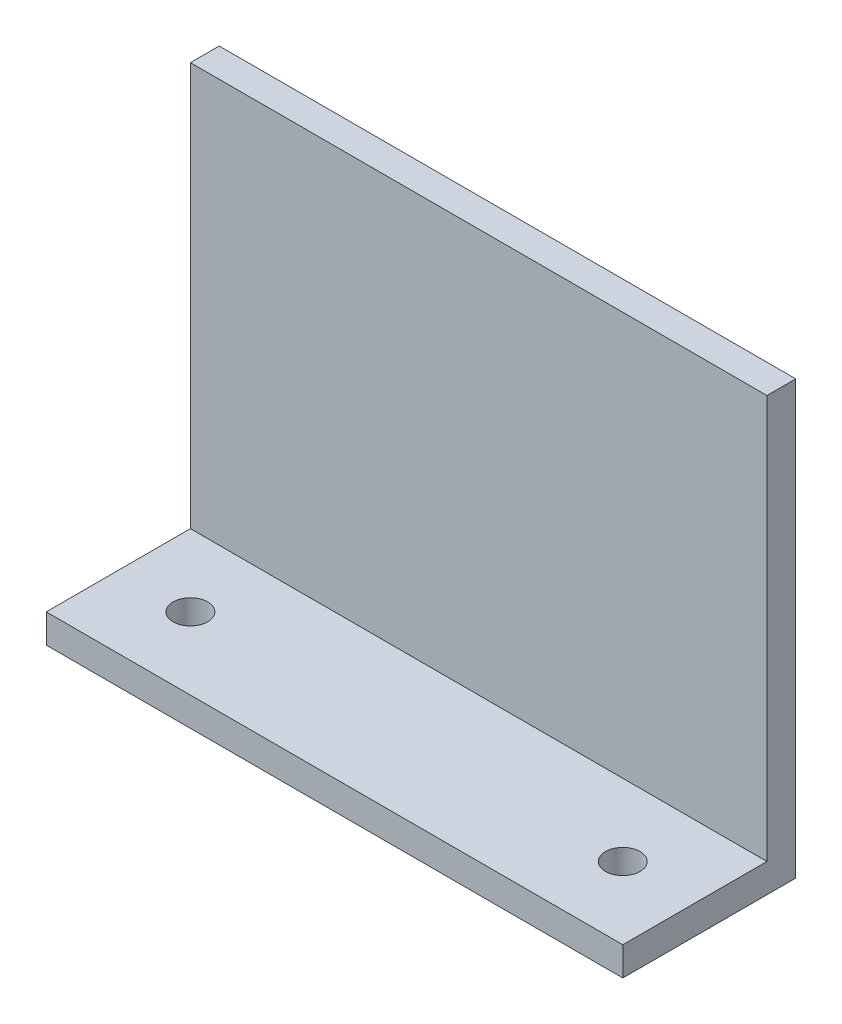
ISO-10303-21;
HEADER;
FILE_DESCRIPTION(('STEP AP214'),'2;1');
FILE_NAME('part.step','',(''),(''),'','','');
FILE_SCHEMA(('AUTOMOTIVE_DESIGN { 1 0 10303 214 1 1 1 1 }'));
ENDSEC;
DATA;
#1=APPLICATION_CONTEXT('core data for automotive mechanical design processes');
#2=APPLICATION_PROTOCOL_DEFINITION('international standard','automotive_design',2000,#1);
#3=PRODUCT_CONTEXT('',#1,'mechanical');
#4=PRODUCT('Part','Part','',(#3));
#5=PRODUCT_RELATED_PRODUCT_CATEGORY('part','',(#4));
#6=PRODUCT_DEFINITION_FORMATION('','',#4);
#7=PRODUCT_DEFINITION_CONTEXT('part definition',#1,'design');
#8=PRODUCT_DEFINITION('design','',#6,#7);
#9=PRODUCT_DEFINITION_SHAPE('','',#8);
#10=(LENGTH_UNIT() NAMED_UNIT(*) SI_UNIT(.MILLI.,.METRE.));
#11=(NAMED_UNIT(*) PLANE_ANGLE_UNIT() SI_UNIT($,.RADIAN.));
#12=(NAMED_UNIT(*) SI_UNIT($,.STERADIAN.) SOLID_ANGLE_UNIT());
#13=UNCERTAINTY_MEASURE_WITH_UNIT(LENGTH_MEASURE(1.E-05),#10,'distance_accuracy_value','');
#14=(GEOMETRIC_REPRESENTATION_CONTEXT(3) GLOBAL_UNCERTAINTY_ASSIGNED_CONTEXT((#13)) GLOBAL_UNIT_ASSIGNED_CONTEXT((#10,
#11,#12)) REPRESENTATION_CONTEXT('',''));
#15=CARTESIAN_POINT('',(0.,0.,0.));
#16=DIRECTION('',(0.,0.,1.));
#17=DIRECTION('',(1.,0.,0.));
#18=AXIS2_PLACEMENT_3D('',#15,#16,#17);
#19=CARTESIAN_POINT('',(0.,0.,10.));
#20=DIRECTION('',(0.,0.,-1.));
#21=DIRECTION('',(-1.,0.,0.));
#22=AXIS2_PLACEMENT_3D('',#19,#20,#21);
#23=PLANE('',#22);
#24=DIRECTION('',(-1.,0.,0.));
#25=VECTOR('',#24,1.);
#26=CARTESIAN_POINT('',(-100.,-65.,10.));
#27=LINE('',#26,#25);
#28=CARTESIAN_POINT('',(100.,-65.,10.));
#29=VERTEX_POINT('',#28);
#30=CARTESIAN_POINT('',(-100.,-65.,10.));
#31=VERTEX_POINT('',#30);
#32=EDGE_CURVE('E48',#29,#31,#27,.T.);
#33=ORIENTED_EDGE('',*,*,#32,.F.);
#34=DIRECTION('',(0.,1.,0.));
#35=VECTOR('',#34,1.);
#36=CARTESIAN_POINT('',(100.,-75.,10.));
#37=LINE('',#36,#35);
#38=CARTESIAN_POINT('',(100.,75.,10.));
#39=VERTEX_POINT('',#38);
#40=EDGE_CURVE('E86',#29,#39,#37,.T.);
#41=ORIENTED_EDGE('',*,*,#40,.T.);
#42=DIRECTION('',(-1.,0.,0.));
#43=VECTOR('',#42,1.);
#44=CARTESIAN_POINT('',(-100.,75.,10.));
#45=LINE('',#44,#43);
#46=CARTESIAN_POINT('',(-100.,75.,10.));
#47=VERTEX_POINT('',#46);
#48=EDGE_CURVE('E54',#39,#47,#45,.T.);
#49=ORIENTED_EDGE('',*,*,#48,.T.);
#50=DIRECTION('',(0.,-1.,0.));
#51=VECTOR('',#50,1.);
#52=CARTESIAN_POINT('',(-100.,-75.,10.));
#53=LINE('',#52,#51);
#54=EDGE_CURVE('E97',#47,#31,#53,.T.);
#55=ORIENTED_EDGE('',*,*,#54,.T.);
#56=EDGE_LOOP('',(#33,#41,#49,#55));
#57=FACE_BOUND('',#56,.T.);
#58=ADVANCED_FACE('F33',(#57),#23,.F.);
#59=CARTESIAN_POINT('',(100.,-75.,10.));
#60=DIRECTION('',(-1.,0.,0.));
#61=DIRECTION('',(0.,0.,1.));
#62=AXIS2_PLACEMENT_3D('',#59,#60,#61);
#63=PLANE('',#62);
#64=DIRECTION('',(0.,1.,0.));
#65=VECTOR('',#64,1.);
#66=CARTESIAN_POINT('',(100.,-75.,0.));
#67=LINE('',#66,#65);
#68=CARTESIAN_POINT('',(100.,-75.,0.));
#69=VERTEX_POINT('',#68);
#70=CARTESIAN_POINT('',(100.,75.,0.));
#71=VERTEX_POINT('',#70);
#72=EDGE_CURVE('E93',#69,#71,#67,.T.);
#73=ORIENTED_EDGE('',*,*,#72,.T.);
#74=DIRECTION('',(0.,0.,-1.));
#75=VECTOR('',#74,1.);
#76=CARTESIAN_POINT('',(100.,75.,10.));
#77=LINE('',#76,#75);
#78=EDGE_CURVE('E11',#39,#71,#77,.T.);
#79=ORIENTED_EDGE('',*,*,#78,.F.);
#80=ORIENTED_EDGE('',*,*,#40,.F.);
#81=DIRECTION('',(0.,0.,-1.));
#82=VECTOR('',#81,1.);
#83=CARTESIAN_POINT('',(100.,-65.,60.));
#84=LINE('',#83,#82);
#85=CARTESIAN_POINT('',(100.,-65.,60.));
#86=VERTEX_POINT('',#85);
#87=EDGE_CURVE('E101',#86,#29,#84,.T.);
#88=ORIENTED_EDGE('',*,*,#87,.F.);
#89=DIRECTION('',(0.,1.,0.));
#90=VECTOR('',#89,1.);
#91=CARTESIAN_POINT('',(100.,-75.,60.));
#92=LINE('',#91,#90);
#93=CARTESIAN_POINT('',(100.,-75.,60.));
#94=VERTEX_POINT('',#93);
#95=EDGE_CURVE('E96',#94,#86,#92,.T.);
#96=ORIENTED_EDGE('',*,*,#95,.F.);
#97=DIRECTION('',(0.,0.,-1.));
#98=VECTOR('',#97,1.);
#99=CARTESIAN_POINT('',(100.,-75.,10.));
#100=LINE('',#99,#98);
#101=EDGE_CURVE('E79',#94,#69,#100,.T.);
#102=ORIENTED_EDGE('',*,*,#101,.T.);
#103=EDGE_LOOP('',(#73,#79,#80,#88,#96,#102));
#104=FACE_BOUND('',#103,.T.);
#105=ADVANCED_FACE('F35',(#104),#63,.F.);
#106=CARTESIAN_POINT('',(-100.,75.,10.));
#107=DIRECTION('',(0.,-1.,0.));
#108=DIRECTION('',(0.,0.,-1.));
#109=AXIS2_PLACEMENT_3D('',#106,#107,#108);
#110=PLANE('',#109);
#111=DIRECTION('',(-1.,0.,0.));
#112=VECTOR('',#111,1.);
#113=CARTESIAN_POINT('',(-100.,75.,0.));
#114=LINE('',#113,#112);
#115=CARTESIAN_POINT('',(-100.,75.,0.));
#116=VERTEX_POINT('',#115);
#117=EDGE_CURVE('E100',#71,#116,#114,.T.);
#118=ORIENTED_EDGE('',*,*,#117,.T.);
#119=DIRECTION('',(0.,0.,-1.));
#120=VECTOR('',#119,1.);
#121=CARTESIAN_POINT('',(-100.,75.,10.));
#122=LINE('',#121,#120);
#123=EDGE_CURVE('E41',#47,#116,#122,.T.);
#124=ORIENTED_EDGE('',*,*,#123,.F.);
#125=ORIENTED_EDGE('',*,*,#48,.F.);
#126=ORIENTED_EDGE('',*,*,#78,.T.);
#127=EDGE_LOOP('',(#118,#124,#125,#126));
#128=FACE_BOUND('',#127,.T.);
#129=ADVANCED_FACE('F117',(#128),#110,.F.);
#130=CARTESIAN_POINT('',(-100.,-75.,10.));
#131=DIRECTION('',(1.,0.,0.));
#132=DIRECTION('',(0.,0.,-1.));
#133=AXIS2_PLACEMENT_3D('',#130,#131,#132);
#134=PLANE('',#133);
#135=DIRECTION('',(0.,-1.,0.));
#136=VECTOR('',#135,1.);
#137=CARTESIAN_POINT('',(-100.,-75.,0.));
#138=LINE('',#137,#136);
#139=CARTESIAN_POINT('',(-100.,-75.,0.));
#140=VERTEX_POINT('',#139);
#141=EDGE_CURVE('E87',#116,#140,#138,.T.);
#142=ORIENTED_EDGE('',*,*,#141,.T.);
#143=DIRECTION('',(0.,0.,-1.));
#144=VECTOR('',#143,1.);
#145=CARTESIAN_POINT('',(-100.,-75.,10.));
#146=LINE('',#145,#144);
#147=CARTESIAN_POINT('',(-100.,-75.,60.));
#148=VERTEX_POINT('',#147);
#149=EDGE_CURVE('E82',#148,#140,#146,.T.);
#150=ORIENTED_EDGE('',*,*,#149,.F.);
#151=DIRECTION('',(0.,-1.,0.));
#152=VECTOR('',#151,1.);
#153=CARTESIAN_POINT('',(-100.,-75.,60.));
#154=LINE('',#153,#152);
#155=CARTESIAN_POINT('',(-100.,-65.,60.));
#156=VERTEX_POINT('',#155);
#157=EDGE_CURVE('E137',#156,#148,#154,.T.);
#158=ORIENTED_EDGE('',*,*,#157,.F.);
#159=DIRECTION('',(0.,0.,-1.));
#160=VECTOR('',#159,1.);
#161=CARTESIAN_POINT('',(-100.,-65.,60.));
#162=LINE('',#161,#160);
#163=EDGE_CURVE('E105',#156,#31,#162,.T.);
#164=ORIENTED_EDGE('',*,*,#163,.T.);
#165=ORIENTED_EDGE('',*,*,#54,.F.);
#166=ORIENTED_EDGE('',*,*,#123,.T.);
#167=EDGE_LOOP('',(#142,#150,#158,#164,#165,#166));
#168=FACE_BOUND('',#167,.T.);
#169=ADVANCED_FACE('F114',(#168),#134,.F.);
#170=CARTESIAN_POINT('',(-100.,-75.,10.));
#171=DIRECTION('',(0.,1.,0.));
#172=DIRECTION('',(0.,0.,1.));
#173=AXIS2_PLACEMENT_3D('',#170,#171,#172);
#174=PLANE('',#173);
#175=CARTESIAN_POINT('',(75.,-75.,35.));
#176=DIRECTION('',(0.,1.,0.));
#177=DIRECTION('',(0.,0.,1.));
#178=AXIS2_PLACEMENT_3D('',#175,#176,#177);
#179=CIRCLE('',#178,6.00000000000001);
#180=CARTESIAN_POINT('',(75.,-75.,41.));
#181=VERTEX_POINT('',#180);
#182=EDGE_CURVE('E154',#181,#181,#179,.T.);
#183=ORIENTED_EDGE('',*,*,#182,.T.);
#184=EDGE_LOOP('',(#183));
#185=FACE_BOUND('',#184,.T.);
#186=CARTESIAN_POINT('',(-75.,-75.,35.));
#187=DIRECTION('',(0.,1.,0.));
#188=DIRECTION('',(0.,0.,1.));
#189=AXIS2_PLACEMENT_3D('',#186,#187,#188);
#190=CIRCLE('',#189,6.00000000000001);
#191=CARTESIAN_POINT('',(-75.,-75.,41.));
#192=VERTEX_POINT('',#191);
#193=EDGE_CURVE('E138',#192,#192,#190,.T.);
#194=ORIENTED_EDGE('',*,*,#193,.T.);
#195=EDGE_LOOP('',(#194));
#196=FACE_BOUND('',#195,.T.);
#197=DIRECTION('',(1.,0.,0.));
#198=VECTOR('',#197,1.);
#199=CARTESIAN_POINT('',(-100.,-75.,0.));
#200=LINE('',#199,#198);
#201=EDGE_CURVE('E74',#140,#69,#200,.T.);
#202=ORIENTED_EDGE('',*,*,#201,.T.);
#203=ORIENTED_EDGE('',*,*,#101,.F.);
#204=DIRECTION('',(1.,0.,0.));
#205=VECTOR('',#204,1.);
#206=CARTESIAN_POINT('',(-100.,-75.,60.));
#207=LINE('',#206,#205);
#208=EDGE_CURVE('E133',#148,#94,#207,.T.);
#209=ORIENTED_EDGE('',*,*,#208,.F.);
#210=ORIENTED_EDGE('',*,*,#149,.T.);
#211=EDGE_LOOP('',(#202,#203,#209,#210));
#212=FACE_BOUND('',#211,.T.);
#213=ADVANCED_FACE('F76',(#185,#196,#212),#174,.F.);
#214=CARTESIAN_POINT('',(0.,0.,0.));
#215=DIRECTION('',(0.,0.,-1.));
#216=DIRECTION('',(-1.,0.,0.));
#217=AXIS2_PLACEMENT_3D('',#214,#215,#216);
#218=PLANE('',#217);
#219=ORIENTED_EDGE('',*,*,#72,.F.);
#220=ORIENTED_EDGE('',*,*,#201,.F.);
#221=ORIENTED_EDGE('',*,*,#141,.F.);
#222=ORIENTED_EDGE('',*,*,#117,.F.);
#223=EDGE_LOOP('',(#219,#220,#221,#222));
#224=FACE_BOUND('',#223,.T.);
#225=ADVANCED_FACE('F99',(#224),#218,.T.);
#226=CARTESIAN_POINT('',(-100.,-65.,60.));
#227=DIRECTION('',(0.,-1.,0.));
#228=DIRECTION('',(0.,0.,-1.));
#229=AXIS2_PLACEMENT_3D('',#226,#227,#228);
#230=PLANE('',#229);
#231=CARTESIAN_POINT('',(75.,-65.,35.));
#232=DIRECTION('',(0.,1.,0.));
#233=DIRECTION('',(0.,0.,1.));
#234=AXIS2_PLACEMENT_3D('',#231,#232,#233);
#235=CIRCLE('',#234,5.99999999999999);
#236=CARTESIAN_POINT('',(75.,-65.,41.));
#237=VERTEX_POINT('',#236);
#238=EDGE_CURVE('E151',#237,#237,#235,.T.);
#239=ORIENTED_EDGE('',*,*,#238,.F.);
#240=EDGE_LOOP('',(#239));
#241=FACE_BOUND('',#240,.T.);
#242=CARTESIAN_POINT('',(-75.,-65.,35.));
#243=DIRECTION('',(0.,1.,0.));
#244=DIRECTION('',(0.,0.,1.));
#245=AXIS2_PLACEMENT_3D('',#242,#243,#244);
#246=CIRCLE('',#245,5.99999999999999);
#247=CARTESIAN_POINT('',(-75.,-65.,41.));
#248=VERTEX_POINT('',#247);
#249=EDGE_CURVE('E148',#248,#248,#246,.T.);
#250=ORIENTED_EDGE('',*,*,#249,.F.);
#251=EDGE_LOOP('',(#250));
#252=FACE_BOUND('',#251,.T.);
#253=ORIENTED_EDGE('',*,*,#32,.T.);
#254=ORIENTED_EDGE('',*,*,#163,.F.);
#255=DIRECTION('',(-1.,0.,0.));
#256=VECTOR('',#255,1.);
#257=CARTESIAN_POINT('',(-100.,-65.,60.));
#258=LINE('',#257,#256);
#259=EDGE_CURVE('E126',#86,#156,#258,.T.);
#260=ORIENTED_EDGE('',*,*,#259,.F.);
#261=ORIENTED_EDGE('',*,*,#87,.T.);
#262=EDGE_LOOP('',(#253,#254,#260,#261));
#263=FACE_BOUND('',#262,.T.);
#264=ADVANCED_FACE('F122',(#241,#252,#263),#230,.F.);
#265=CARTESIAN_POINT('',(0.,0.,60.));
#266=DIRECTION('',(0.,0.,-1.));
#267=DIRECTION('',(-1.,0.,0.));
#268=AXIS2_PLACEMENT_3D('',#265,#266,#267);
#269=PLANE('',#268);
#270=ORIENTED_EDGE('',*,*,#157,.T.);
#271=ORIENTED_EDGE('',*,*,#208,.T.);
#272=ORIENTED_EDGE('',*,*,#95,.T.);
#273=ORIENTED_EDGE('',*,*,#259,.T.);
#274=EDGE_LOOP('',(#270,#271,#272,#273));
#275=FACE_BOUND('',#274,.T.);
#276=ADVANCED_FACE('F143',(#275),#269,.F.);
#277=CARTESIAN_POINT('',(-75.,-65.,35.));
#278=DIRECTION('',(0.,1.,0.));
#279=DIRECTION('',(0.,0.,1.));
#280=AXIS2_PLACEMENT_3D('',#277,#278,#279);
#281=CYLINDRICAL_SURFACE('',#280,6.);
#282=ORIENTED_EDGE('',*,*,#193,.F.);
#283=EDGE_LOOP('',(#282));
#284=FACE_BOUND('',#283,.T.);
#285=ORIENTED_EDGE('',*,*,#249,.T.);
#286=EDGE_LOOP('',(#285));
#287=FACE_BOUND('',#286,.T.);
#288=ADVANCED_FACE('F163',(#284,#287),#281,.F.);
#289=CARTESIAN_POINT('',(75.,-65.,35.));
#290=DIRECTION('',(0.,1.,0.));
#291=DIRECTION('',(0.,0.,1.));
#292=AXIS2_PLACEMENT_3D('',#289,#290,#291);
#293=CYLINDRICAL_SURFACE('',#292,6.);
#294=ORIENTED_EDGE('',*,*,#182,.F.);
#295=EDGE_LOOP('',(#294));
#296=FACE_BOUND('',#295,.T.);
#297=ORIENTED_EDGE('',*,*,#238,.T.);
#298=EDGE_LOOP('',(#297));
#299=FACE_BOUND('',#298,.T.);
#300=ADVANCED_FACE('F160',(#296,#299),#293,.F.);
#301=CLOSED_SHELL('',(#58,#105,#129,#169,#213,#225,#264,#276,#288,#300));
#302=MANIFOLD_SOLID_BREP('B2',#301);
#303=ADVANCED_BREP_SHAPE_REPRESENTATION('',(#18,#302),#14);
#304=SHAPE_DEFINITION_REPRESENTATION(#9,#303);
ENDSEC;
END-ISO-10303-21;
